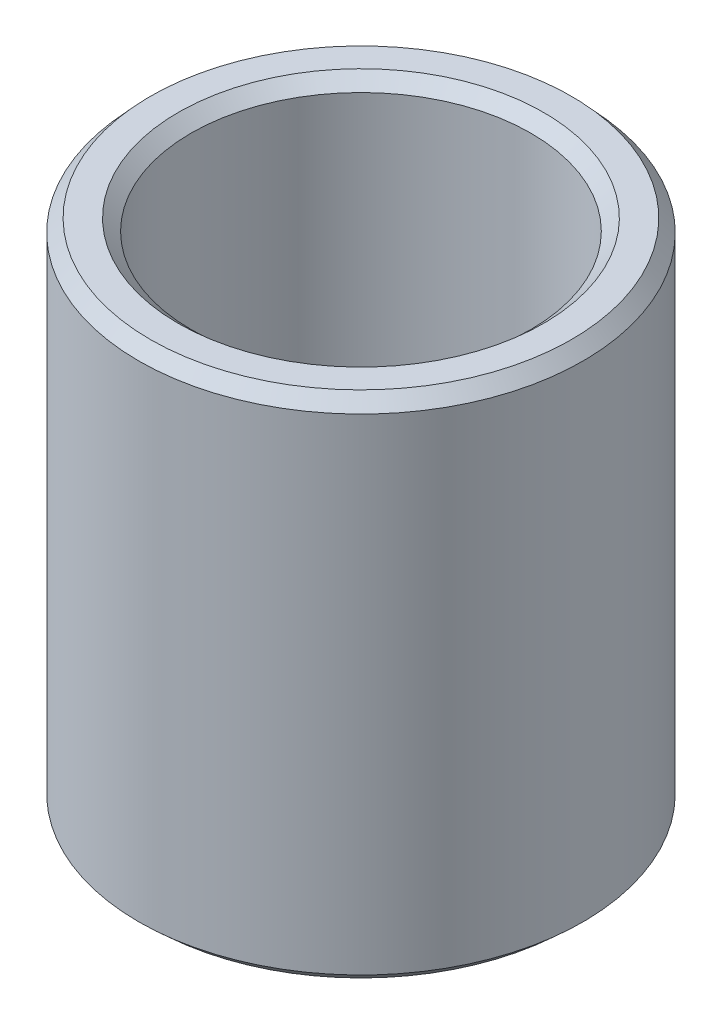
ISO-10303-21;
HEADER;
FILE_DESCRIPTION(('STEP AP214'),'2;1');
FILE_NAME('part.step','',(''),(''),'','','');
FILE_SCHEMA(('AUTOMOTIVE_DESIGN { 1 0 10303 214 1 1 1 1 }'));
ENDSEC;
DATA;
#1=APPLICATION_CONTEXT('core data for automotive mechanical design processes');
#2=APPLICATION_PROTOCOL_DEFINITION('international standard','automotive_design',2000,#1);
#3=PRODUCT_CONTEXT('',#1,'mechanical');
#4=PRODUCT('Part','Part','',(#3));
#5=PRODUCT_RELATED_PRODUCT_CATEGORY('part','',(#4));
#6=PRODUCT_DEFINITION_FORMATION('','',#4);
#7=PRODUCT_DEFINITION_CONTEXT('part definition',#1,'design');
#8=PRODUCT_DEFINITION('design','',#6,#7);
#9=PRODUCT_DEFINITION_SHAPE('','',#8);
#10=(LENGTH_UNIT() NAMED_UNIT(*) SI_UNIT(.MILLI.,.METRE.));
#11=(NAMED_UNIT(*) PLANE_ANGLE_UNIT() SI_UNIT($,.RADIAN.));
#12=(NAMED_UNIT(*) SI_UNIT($,.STERADIAN.) SOLID_ANGLE_UNIT());
#13=UNCERTAINTY_MEASURE_WITH_UNIT(LENGTH_MEASURE(1.E-05),#10,'distance_accuracy_value','');
#14=(GEOMETRIC_REPRESENTATION_CONTEXT(3) GLOBAL_UNCERTAINTY_ASSIGNED_CONTEXT((#13)) GLOBAL_UNIT_ASSIGNED_CONTEXT((#10,
#11,#12)) REPRESENTATION_CONTEXT('',''));
#15=CARTESIAN_POINT('',(0.,0.,0.));
#16=DIRECTION('',(0.,0.,1.));
#17=DIRECTION('',(1.,0.,0.));
#18=AXIS2_PLACEMENT_3D('',#15,#16,#17);
#19=CARTESIAN_POINT('',(0.,137.723440901435,0.));
#20=DIRECTION('',(0.,-1.,0.));
#21=DIRECTION('',(0.,0.,-1.));
#22=AXIS2_PLACEMENT_3D('',#19,#20,#21);
#23=CYLINDRICAL_SURFACE('',#22,60.);
#24=CARTESIAN_POINT('',(0.,3.13205476962197,0.));
#25=DIRECTION('',(0.,1.,0.));
#26=DIRECTION('',(0.,0.,1.));
#27=AXIS2_PLACEMENT_3D('',#24,#25,#26);
#28=CIRCLE('',#27,60.);
#29=CARTESIAN_POINT('',(0.,3.13205476962197,60.));
#30=VERTEX_POINT('',#29);
#31=EDGE_CURVE('E10',#30,#30,#28,.T.);
#32=ORIENTED_EDGE('',*,*,#31,.T.);
#33=EDGE_LOOP('',(#32));
#34=FACE_BOUND('',#33,.T.);
#35=CARTESIAN_POINT('',(0.,134.280394252838,0.));
#36=DIRECTION('',(0.,1.,0.));
#37=DIRECTION('',(0.,0.,1.));
#38=AXIS2_PLACEMENT_3D('',#35,#36,#37);
#39=CIRCLE('',#38,60.);
#40=CARTESIAN_POINT('',(0.,134.280394252838,60.));
#41=VERTEX_POINT('',#40);
#42=EDGE_CURVE('E50',#41,#41,#39,.F.);
#43=ORIENTED_EDGE('',*,*,#42,.T.);
#44=EDGE_LOOP('',(#43));
#45=FACE_BOUND('',#44,.T.);
#46=ADVANCED_FACE('F39',(#34,#45),#23,.T.);
#47=CARTESIAN_POINT('',(0.,137.723440901435,0.));
#48=DIRECTION('',(0.,1.,0.));
#49=DIRECTION('',(0.,0.,1.));
#50=AXIS2_PLACEMENT_3D('',#47,#48,#49);
#51=PLANE('',#50);
#52=CARTESIAN_POINT('',(0.,137.723440901435,0.));
#53=DIRECTION('',(0.,1.,0.));
#54=DIRECTION('',(0.,0.,1.));
#55=AXIS2_PLACEMENT_3D('',#52,#53,#54);
#56=CIRCLE('',#55,49.3367924582111);
#57=CARTESIAN_POINT('',(0.,137.723440901435,49.3367924582111));
#58=VERTEX_POINT('',#57);
#59=EDGE_CURVE('E58',#58,#58,#56,.F.);
#60=ORIENTED_EDGE('',*,*,#59,.T.);
#61=EDGE_LOOP('',(#60));
#62=FACE_BOUND('',#61,.T.);
#63=CARTESIAN_POINT('',(0.,137.723440901435,0.));
#64=DIRECTION('',(0.,1.,0.));
#65=DIRECTION('',(0.,0.,1.));
#66=AXIS2_PLACEMENT_3D('',#63,#64,#65);
#67=CIRCLE('',#66,56.8679452303781);
#68=CARTESIAN_POINT('',(0.,137.723440901435,56.8679452303781));
#69=VERTEX_POINT('',#68);
#70=EDGE_CURVE('E61',#69,#69,#67,.T.);
#71=ORIENTED_EDGE('',*,*,#70,.T.);
#72=EDGE_LOOP('',(#71));
#73=FACE_BOUND('',#72,.T.);
#74=ADVANCED_FACE('F88',(#62,#73),#51,.T.);
#75=CARTESIAN_POINT('',(0.,0.,0.));
#76=DIRECTION('',(0.,1.,0.));
#77=DIRECTION('',(0.,0.,1.));
#78=AXIS2_PLACEMENT_3D('',#75,#76,#77);
#79=PLANE('',#78);
#80=CARTESIAN_POINT('',(0.,0.,0.));
#81=DIRECTION('',(0.,1.,0.));
#82=DIRECTION('',(0.,0.,1.));
#83=AXIS2_PLACEMENT_3D('',#80,#81,#82);
#84=CIRCLE('',#83,49.0258005792363);
#85=CARTESIAN_POINT('',(0.,0.,49.0258005792363));
#86=VERTEX_POINT('',#85);
#87=EDGE_CURVE('E51',#86,#86,#84,.T.);
#88=ORIENTED_EDGE('',*,*,#87,.T.);
#89=EDGE_LOOP('',(#88));
#90=FACE_BOUND('',#89,.T.);
#91=CARTESIAN_POINT('',(0.,0.,0.));
#92=DIRECTION('',(0.,1.,0.));
#93=DIRECTION('',(0.,0.,1.));
#94=AXIS2_PLACEMENT_3D('',#91,#92,#93);
#95=CIRCLE('',#94,56.5569533514032);
#96=CARTESIAN_POINT('',(0.,0.,56.5569533514032));
#97=VERTEX_POINT('',#96);
#98=EDGE_CURVE('E54',#97,#97,#95,.F.);
#99=ORIENTED_EDGE('',*,*,#98,.T.);
#100=EDGE_LOOP('',(#99));
#101=FACE_BOUND('',#100,.T.);
#102=ADVANCED_FACE('F83',(#90,#101),#79,.F.);
#103=CARTESIAN_POINT('',(0.,137.723440901435,0.));
#104=DIRECTION('',(0.,-1.,0.));
#105=DIRECTION('',(0.,0.,-1.));
#106=AXIS2_PLACEMENT_3D('',#103,#104,#105);
#107=CYLINDRICAL_SURFACE('',#106,45.8937458096143);
#108=CARTESIAN_POINT('',(0.,134.591386131813,0.));
#109=DIRECTION('',(0.,1.,0.));
#110=DIRECTION('',(0.,0.,1.));
#111=AXIS2_PLACEMENT_3D('',#108,#109,#110);
#112=CIRCLE('',#111,45.8937458096143);
#113=CARTESIAN_POINT('',(0.,134.591386131813,45.8937458096143));
#114=VERTEX_POINT('',#113);
#115=EDGE_CURVE('E67',#114,#114,#112,.T.);
#116=ORIENTED_EDGE('',*,*,#115,.T.);
#117=EDGE_LOOP('',(#116));
#118=FACE_BOUND('',#117,.T.);
#119=CARTESIAN_POINT('',(0.,3.44304664859679,0.));
#120=DIRECTION('',(0.,1.,0.));
#121=DIRECTION('',(0.,0.,1.));
#122=AXIS2_PLACEMENT_3D('',#119,#120,#121);
#123=CIRCLE('',#122,45.8937458096143);
#124=CARTESIAN_POINT('',(0.,3.44304664859679,45.8937458096143));
#125=VERTEX_POINT('',#124);
#126=EDGE_CURVE('E69',#125,#125,#123,.F.);
#127=ORIENTED_EDGE('',*,*,#126,.T.);
#128=EDGE_LOOP('',(#127));
#129=FACE_BOUND('',#128,.T.);
#130=ADVANCED_FACE('F71',(#118,#129),#107,.F.);
#131=CARTESIAN_POINT('',(0.,134.591386131813,0.));
#132=DIRECTION('',(0.,1.,0.));
#133=DIRECTION('',(0.,0.,1.));
#134=AXIS2_PLACEMENT_3D('',#131,#132,#133);
#135=CONICAL_SURFACE('',#134,45.8937458096143,0.83266135512635);
#136=ORIENTED_EDGE('',*,*,#59,.F.);
#137=EDGE_LOOP('',(#136));
#138=FACE_BOUND('',#137,.T.);
#139=ORIENTED_EDGE('',*,*,#115,.F.);
#140=EDGE_LOOP('',(#139));
#141=FACE_BOUND('',#140,.T.);
#142=ADVANCED_FACE('F77',(#138,#141),#135,.F.);
#143=CARTESIAN_POINT('',(0.,0.,0.));
#144=DIRECTION('',(0.,-1.,0.));
#145=DIRECTION('',(0.,0.,-1.));
#146=AXIS2_PLACEMENT_3D('',#143,#144,#145);
#147=CONICAL_SURFACE('',#146,49.0258005792363,0.738134971668549);
#148=ORIENTED_EDGE('',*,*,#126,.F.);
#149=EDGE_LOOP('',(#148));
#150=FACE_BOUND('',#149,.T.);
#151=ORIENTED_EDGE('',*,*,#87,.F.);
#152=EDGE_LOOP('',(#151));
#153=FACE_BOUND('',#152,.T.);
#154=ADVANCED_FACE('F73',(#150,#153),#147,.F.);
#155=CARTESIAN_POINT('',(0.,3.13205476962197,0.));
#156=DIRECTION('',(0.,1.,0.));
#157=DIRECTION('',(0.,0.,1.));
#158=AXIS2_PLACEMENT_3D('',#155,#156,#157);
#159=CONICAL_SURFACE('',#158,60.,0.832661355126349);
#160=CARTESIAN_POINT('',(0.,0.,56.5569533514032));
#161=CARTESIAN_POINT('',(0.,0.0326255705168959,56.5928184206594));
#162=CARTESIAN_POINT('',(0.,0.065251141033791,56.6286834899156));
#163=CARTESIAN_POINT('',(0.,0.130502282067581,56.7004136284281));
#164=CARTESIAN_POINT('',(0.,0.163127852584477,56.7362786976843));
#165=CARTESIAN_POINT('',(0.,0.228378993618268,56.8080088361967));
#166=CARTESIAN_POINT('',(0.,0.261004564135164,56.8438739054529));
#167=CARTESIAN_POINT('',(0.,0.326255705168956,56.9156040439654));
#168=CARTESIAN_POINT('',(0.,0.358881275685851,56.9514691132216));
#169=CARTESIAN_POINT('',(0.,0.424132416719641,57.023199251734));
#170=CARTESIAN_POINT('',(0.,0.456757987236537,57.0590643209902));
#171=CARTESIAN_POINT('',(0.,0.522009128270328,57.1307944595027));
#172=CARTESIAN_POINT('',(0.,0.554634698787224,57.1666595287589));
#173=CARTESIAN_POINT('',(0.,0.619885839821015,57.2383896672713));
#174=CARTESIAN_POINT('',(0.,0.65251141033791,57.2742547365275));
#175=CARTESIAN_POINT('',(0.,0.717762551371701,57.34598487504));
#176=CARTESIAN_POINT('',(0.,0.750388121888598,57.3818499442962));
#177=CARTESIAN_POINT('',(0.,0.815639262922389,57.4535800828086));
#178=CARTESIAN_POINT('',(0.,0.848264833439284,57.4894451520648));
#179=CARTESIAN_POINT('',(0.,0.913515974473075,57.5611752905773));
#180=CARTESIAN_POINT('',(0.,0.94614154498997,57.5970403598335));
#181=CARTESIAN_POINT('',(0.,1.01139268602376,57.6687704983459));
#182=CARTESIAN_POINT('',(0.,1.04401825654066,57.7046355676021));
#183=CARTESIAN_POINT('',(0.,1.10926939757445,57.7763657061146));
#184=CARTESIAN_POINT('',(0.,1.14189496809134,57.8122307753708));
#185=CARTESIAN_POINT('',(0.,1.20714610912513,57.8839609138832));
#186=CARTESIAN_POINT('',(0.,1.23977167964203,57.9198259831394));
#187=CARTESIAN_POINT('',(0.,1.30502282067582,57.9915561216519));
#188=CARTESIAN_POINT('',(0.,1.33764839119272,58.0274211909081));
#189=CARTESIAN_POINT('',(0.,1.40289953222651,58.0991513294205));
#190=CARTESIAN_POINT('',(0.,1.4355251027434,58.1350163986767));
#191=CARTESIAN_POINT('',(0.,1.50077624377719,58.2067465371892));
#192=CARTESIAN_POINT('',(0.,1.53340181429409,58.2426116064454));
#193=CARTESIAN_POINT('',(0.,1.59865295532788,58.3143417449578));
#194=CARTESIAN_POINT('',(0.,1.63127852584478,58.350206814214));
#195=CARTESIAN_POINT('',(0.,1.69652966687857,58.4219369527265));
#196=CARTESIAN_POINT('',(0.,1.72915523739546,58.4578020219827));
#197=CARTESIAN_POINT('',(0.,1.79440637842925,58.5295321604951));
#198=CARTESIAN_POINT('',(0.,1.82703194894615,58.5653972297513));
#199=CARTESIAN_POINT('',(0.,1.89228308997994,58.6371273682638));
#200=CARTESIAN_POINT('',(0.,1.92490866049684,58.67299243752));
#201=CARTESIAN_POINT('',(0.,1.99015980153063,58.7447225760324));
#202=CARTESIAN_POINT('',(0.,2.02278537204752,58.7805876452886));
#203=CARTESIAN_POINT('',(0.,2.08803651308131,58.8523177838011));
#204=CARTESIAN_POINT('',(0.,2.12066208359821,58.8881828530573));
#205=CARTESIAN_POINT('',(0.,2.185913224632,58.9599129915697));
#206=CARTESIAN_POINT('',(0.,2.2185387951489,58.9957780608259));
#207=CARTESIAN_POINT('',(0.,2.28378993618269,59.0675081993384));
#208=CARTESIAN_POINT('',(0.,2.31641550669958,59.1033732685946));
#209=CARTESIAN_POINT('',(0.,2.38166664773338,59.175103407107));
#210=CARTESIAN_POINT('',(0.,2.41429221825027,59.2109684763632));
#211=CARTESIAN_POINT('',(0.,2.47954335928406,59.2826986148757));
#212=CARTESIAN_POINT('',(0.,2.51216892980096,59.3185636841319));
#213=CARTESIAN_POINT('',(0.,2.57742007083475,59.3902938226443));
#214=CARTESIAN_POINT('',(0.,2.61004564135164,59.4261588919005));
#215=CARTESIAN_POINT('',(0.,2.67529678238543,59.497889030413));
#216=CARTESIAN_POINT('',(0.,2.70792235290233,59.5337540996692));
#217=CARTESIAN_POINT('',(0.,2.77317349393612,59.6054842381816));
#218=CARTESIAN_POINT('',(0.,2.80579906445302,59.6413493074378));
#219=CARTESIAN_POINT('',(0.,2.87105020548681,59.7130794459503));
#220=CARTESIAN_POINT('',(0.,2.9036757760037,59.7489445152065));
#221=CARTESIAN_POINT('',(0.,2.96892691703749,59.8206746537189));
#222=CARTESIAN_POINT('',(0.,3.00155248755439,59.8565397229751));
#223=CARTESIAN_POINT('',(0.,3.06680362858818,59.9282698614876));
#224=CARTESIAN_POINT('',(0.,3.09942919910508,59.9641349307438));
#225=CARTESIAN_POINT('',(0.,3.13205476962197,60.));
#226=B_SPLINE_CURVE_WITH_KNOTS('',3,(#160,#161,#162,#163,#164,#165,#166,#167,#168,#169,#170,
#171,#172,#173,#174,#175,#176,#177,#178,#179,#180,#181,#182,#183,#184,#185,#186,#187,#188,#189,
#190,#191,#192,#193,#194,#195,#196,#197,#198,#199,#200,#201,#202,#203,#204,#205,#206,#207,#208,
#209,#210,#211,#212,#213,#214,#215,#216,#217,#218,#219,#220,#221,#222,#223,#224,#225),
.UNSPECIFIED.,.F.,.F.,(4,2,2,2,2,2,2,2,2,2,2,2,2,2,2,2,2,2,2,2,2,2,2,2,2,2,2,2,2,2,2,2,4),(0.,
0.145453014402437,0.290906028804874,0.436359043207306,0.581812057609744,0.727265072012181,
0.872718086414618,1.01817110081706,1.16362411521949,1.30907712962192,1.45453014402436,
1.5999831584268,1.74543617282924,1.89088918723167,2.03634220163411,2.18179521603654,
2.32724823043898,2.47270124484142,2.61815425924385,2.76360727364629,2.90906028804872,
3.05451330245116,3.1999663168536,3.34541933125603,3.49087234565847,3.6363253600609,
3.78177837446334,3.92723138886578,4.07268440326821,4.21813741767065,4.36359043207308,
4.50904344647552,4.65449646087796),.UNSPECIFIED.);
#227=EDGE_CURVE('BSEAM76',#97,#30,#226,.T.);
#228=ORIENTED_EDGE('',*,*,#98,.F.);
#229=ORIENTED_EDGE('',*,*,#31,.F.);
#230=ORIENTED_EDGE('',*,*,#227,.T.);
#231=ORIENTED_EDGE('',*,*,#227,.F.);
#232=EDGE_LOOP('',(#228,#230,#229,#231));
#233=FACE_BOUND('',#232,.T.);
#234=ADVANCED_FACE('F76',(#233),#159,.T.);
#235=CARTESIAN_POINT('',(0.,137.723440901435,0.));
#236=DIRECTION('',(0.,-1.,0.));
#237=DIRECTION('',(0.,0.,-1.));
#238=AXIS2_PLACEMENT_3D('',#235,#236,#237);
#239=CONICAL_SURFACE('',#238,56.8679452303781,0.73813497166854);
#240=ORIENTED_EDGE('',*,*,#42,.F.);
#241=EDGE_LOOP('',(#240));
#242=FACE_BOUND('',#241,.T.);
#243=ORIENTED_EDGE('',*,*,#70,.F.);
#244=EDGE_LOOP('',(#243));
#245=FACE_BOUND('',#244,.T.);
#246=ADVANCED_FACE('F45',(#242,#245),#239,.T.);
#247=CLOSED_SHELL('',(#46,#74,#102,#130,#142,#154,#234,#246));
#248=MANIFOLD_SOLID_BREP('B2',#247);
#249=ADVANCED_BREP_SHAPE_REPRESENTATION('',(#18,#248),#14);
#250=SHAPE_DEFINITION_REPRESENTATION(#9,#249);
ENDSEC;
END-ISO-10303-21;
